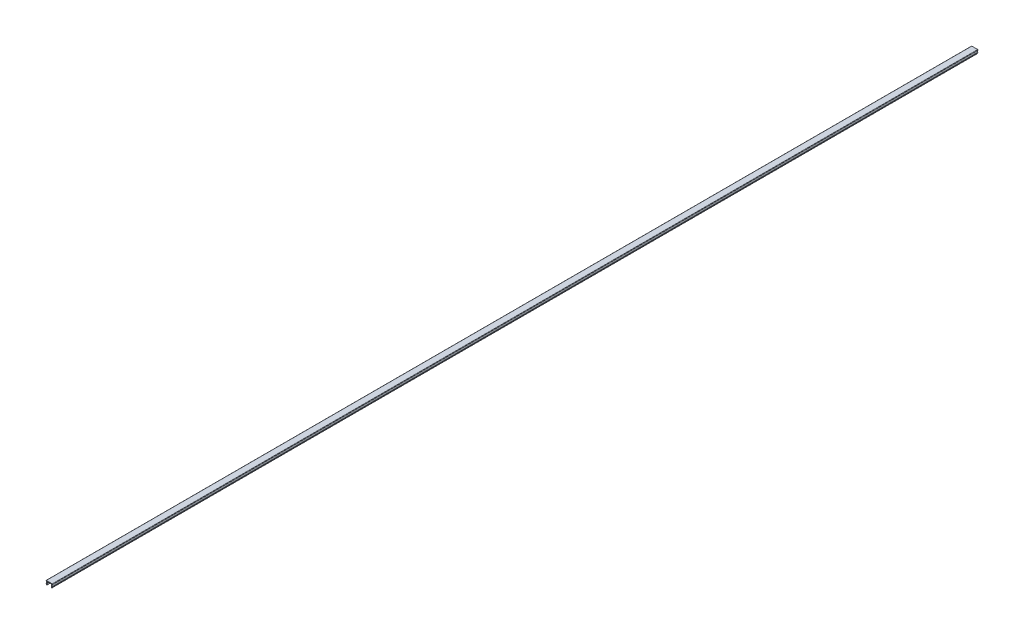
ISO-10303-21;
HEADER;
FILE_DESCRIPTION(('STEP AP214'),'2;1');
FILE_NAME('part.step','',(''),(''),'','','');
FILE_SCHEMA(('AUTOMOTIVE_DESIGN { 1 0 10303 214 1 1 1 1 }'));
ENDSEC;
DATA;
#1=APPLICATION_CONTEXT('core data for automotive mechanical design processes');
#2=APPLICATION_PROTOCOL_DEFINITION('international standard','automotive_design',2000,#1);
#3=PRODUCT_CONTEXT('',#1,'mechanical');
#4=PRODUCT('Part','Part','',(#3));
#5=PRODUCT_RELATED_PRODUCT_CATEGORY('part','',(#4));
#6=PRODUCT_DEFINITION_FORMATION('','',#4);
#7=PRODUCT_DEFINITION_CONTEXT('part definition',#1,'design');
#8=PRODUCT_DEFINITION('design','',#6,#7);
#9=PRODUCT_DEFINITION_SHAPE('','',#8);
#10=(LENGTH_UNIT() NAMED_UNIT(*) SI_UNIT(.MILLI.,.METRE.));
#11=(NAMED_UNIT(*) PLANE_ANGLE_UNIT() SI_UNIT($,.RADIAN.));
#12=(NAMED_UNIT(*) SI_UNIT($,.STERADIAN.) SOLID_ANGLE_UNIT());
#13=UNCERTAINTY_MEASURE_WITH_UNIT(LENGTH_MEASURE(1.E-05),#10,'distance_accuracy_value','');
#14=(GEOMETRIC_REPRESENTATION_CONTEXT(3) GLOBAL_UNCERTAINTY_ASSIGNED_CONTEXT((#13)) GLOBAL_UNIT_ASSIGNED_CONTEXT((#10,
#11,#12)) REPRESENTATION_CONTEXT('',''));
#15=CARTESIAN_POINT('',(0.,0.,0.));
#16=DIRECTION('',(0.,0.,1.));
#17=DIRECTION('',(1.,0.,0.));
#18=AXIS2_PLACEMENT_3D('',#15,#16,#17);
#19=CARTESIAN_POINT('',(-1.62833862518597,3.54999984480356,1000.));
#20=DIRECTION('',(0.,1.,0.));
#21=DIRECTION('',(0.,0.,1.));
#22=AXIS2_PLACEMENT_3D('',#19,#20,#21);
#23=PLANE('',#22);
#24=DIRECTION('',(0.,0.,-1.));
#25=VECTOR('',#24,1.);
#26=CARTESIAN_POINT('',(4.17268348863716,3.54999984480356,1000.));
#27=LINE('',#26,#25);
#28=CARTESIAN_POINT('',(4.17268348863716,3.54999984480356,1000.));
#29=VERTEX_POINT('',#28);
#30=CARTESIAN_POINT('',(4.17268348863716,3.54999984480356,0.));
#31=VERTEX_POINT('',#30);
#32=EDGE_CURVE('E162',#29,#31,#27,.T.);
#33=ORIENTED_EDGE('',*,*,#32,.F.);
#34=DIRECTION('',(1.,0.,0.));
#35=VECTOR('',#34,1.);
#36=CARTESIAN_POINT('',(-1.62833862518597,3.54999984480356,1000.));
#37=LINE('',#36,#35);
#38=CARTESIAN_POINT('',(-0.4293607390091,3.54999984480356,1000.));
#39=VERTEX_POINT('',#38);
#40=EDGE_CURVE('E232',#39,#29,#37,.T.);
#41=ORIENTED_EDGE('',*,*,#40,.F.);
#42=DIRECTION('',(0.,0.,-1.));
#43=VECTOR('',#42,1.);
#44=CARTESIAN_POINT('',(-0.4293607390091,3.54999984480356,1000.));
#45=LINE('',#44,#43);
#46=CARTESIAN_POINT('',(-0.4293607390091,3.54999984480356,0.));
#47=VERTEX_POINT('',#46);
#48=EDGE_CURVE('E245',#39,#47,#45,.T.);
#49=ORIENTED_EDGE('',*,*,#48,.T.);
#50=DIRECTION('',(1.,0.,0.));
#51=VECTOR('',#50,1.);
#52=CARTESIAN_POINT('',(-1.62833862518597,3.54999984480356,0.));
#53=LINE('',#52,#51);
#54=EDGE_CURVE('E240',#47,#31,#53,.T.);
#55=ORIENTED_EDGE('',*,*,#54,.T.);
#56=EDGE_LOOP('',(#33,#41,#49,#55));
#57=FACE_BOUND('',#56,.T.);
#58=ADVANCED_FACE('F16',(#57),#23,.F.);
#59=CARTESIAN_POINT('',(-1.32833862518597,3.54999984480356,1000.));
#60=VERTEX_POINT('',#59);
#61=CARTESIAN_POINT('',(-1.03981651136284,3.54999984480356,1000.));
#62=VERTEX_POINT('',#61);
#63=EDGE_CURVE('E229',#60,#62,#37,.T.);
#64=ORIENTED_EDGE('',*,*,#63,.F.);
#65=DIRECTION('',(0.,0.,-1.));
#66=VECTOR('',#65,1.);
#67=CARTESIAN_POINT('',(-1.32833862518597,3.54999984480356,0.));
#68=LINE('',#67,#66);
#69=CARTESIAN_POINT('',(-1.32833862518597,3.54999984480356,0.));
#70=VERTEX_POINT('',#69);
#71=EDGE_CURVE('E25',#60,#70,#68,.T.);
#72=ORIENTED_EDGE('',*,*,#71,.T.);
#73=CARTESIAN_POINT('',(-1.03981651136284,3.54999984480356,0.));
#74=VERTEX_POINT('',#73);
#75=EDGE_CURVE('E237',#70,#74,#53,.T.);
#76=ORIENTED_EDGE('',*,*,#75,.T.);
#77=DIRECTION('',(0.,0.,-1.));
#78=VECTOR('',#77,1.);
#79=CARTESIAN_POINT('',(-1.03981651136284,3.54999984480356,1000.));
#80=LINE('',#79,#78);
#81=EDGE_CURVE('E236',#62,#74,#80,.T.);
#82=ORIENTED_EDGE('',*,*,#81,.F.);
#83=EDGE_LOOP('',(#64,#72,#76,#82));
#84=FACE_BOUND('',#83,.T.);
#85=ADVANCED_FACE('F318',(#84),#23,.F.);
#86=CARTESIAN_POINT('',(4.7831392609909,3.54999984480356,0.));
#87=VERTEX_POINT('',#86);
#88=CARTESIAN_POINT('',(5.07166137481403,3.54999984480356,0.));
#89=VERTEX_POINT('',#88);
#90=EDGE_CURVE('E228',#87,#89,#53,.T.);
#91=ORIENTED_EDGE('',*,*,#90,.T.);
#92=DIRECTION('',(0.,0.,-1.));
#93=VECTOR('',#92,1.);
#94=CARTESIAN_POINT('',(5.07166137481403,3.54999984480356,1000.));
#95=LINE('',#94,#93);
#96=CARTESIAN_POINT('',(5.07166137481403,3.54999984480356,1000.));
#97=VERTEX_POINT('',#96);
#98=EDGE_CURVE('E10',#89,#97,#95,.F.);
#99=ORIENTED_EDGE('',*,*,#98,.T.);
#100=CARTESIAN_POINT('',(4.7831392609909,3.54999984480356,1000.));
#101=VERTEX_POINT('',#100);
#102=EDGE_CURVE('E233',#101,#97,#37,.T.);
#103=ORIENTED_EDGE('',*,*,#102,.F.);
#104=DIRECTION('',(0.,0.,-1.));
#105=VECTOR('',#104,1.);
#106=CARTESIAN_POINT('',(4.7831392609909,3.54999984480356,1000.));
#107=LINE('',#106,#105);
#108=EDGE_CURVE('E191',#101,#87,#107,.T.);
#109=ORIENTED_EDGE('',*,*,#108,.T.);
#110=EDGE_LOOP('',(#91,#99,#103,#109));
#111=FACE_BOUND('',#110,.T.);
#112=ADVANCED_FACE('F287',(#111),#23,.F.);
#113=CARTESIAN_POINT('',(-1.62833862518597,4.14999984480356,1000.));
#114=DIRECTION('',(0.,1.,0.));
#115=DIRECTION('',(0.,0.,1.));
#116=AXIS2_PLACEMENT_3D('',#113,#114,#115);
#117=PLANE('',#116);
#118=DIRECTION('',(1.,0.,0.));
#119=VECTOR('',#118,1.);
#120=CARTESIAN_POINT('',(-1.62833862518597,4.14999984480356,0.));
#121=LINE('',#120,#119);
#122=CARTESIAN_POINT('',(-1.32833862518597,4.14999984480356,0.));
#123=VERTEX_POINT('',#122);
#124=CARTESIAN_POINT('',(5.07166137481403,4.14999984480356,0.));
#125=VERTEX_POINT('',#124);
#126=EDGE_CURVE('E239',#123,#125,#121,.T.);
#127=ORIENTED_EDGE('',*,*,#126,.F.);
#128=DIRECTION('',(0.,0.,-1.));
#129=VECTOR('',#128,1.);
#130=CARTESIAN_POINT('',(-1.32833862518597,4.14999984480356,1000.));
#131=LINE('',#130,#129);
#132=CARTESIAN_POINT('',(-1.32833862518597,4.14999984480356,1000.));
#133=VERTEX_POINT('',#132);
#134=EDGE_CURVE('E258',#123,#133,#131,.F.);
#135=ORIENTED_EDGE('',*,*,#134,.T.);
#136=DIRECTION('',(1.,0.,0.));
#137=VECTOR('',#136,1.);
#138=CARTESIAN_POINT('',(-1.62833862518597,4.14999984480356,1000.));
#139=LINE('',#138,#137);
#140=CARTESIAN_POINT('',(5.07166137481403,4.14999984480356,1000.));
#141=VERTEX_POINT('',#140);
#142=EDGE_CURVE('E231',#133,#141,#139,.T.);
#143=ORIENTED_EDGE('',*,*,#142,.T.);
#144=DIRECTION('',(0.,0.,-1.));
#145=VECTOR('',#144,1.);
#146=CARTESIAN_POINT('',(5.07166137481403,4.14999984480356,1000.));
#147=LINE('',#146,#145);
#148=EDGE_CURVE('E255',#141,#125,#147,.T.);
#149=ORIENTED_EDGE('',*,*,#148,.T.);
#150=EDGE_LOOP('',(#127,#135,#143,#149));
#151=FACE_BOUND('',#150,.T.);
#152=ADVANCED_FACE('F327',(#151),#117,.T.);
#153=CARTESIAN_POINT('',(0.,0.,1000.));
#154=DIRECTION('',(0.,0.,-1.));
#155=DIRECTION('',(-1.,0.,0.));
#156=AXIS2_PLACEMENT_3D('',#153,#154,#155);
#157=PLANE('',#156);
#158=ORIENTED_EDGE('',*,*,#142,.F.);
#159=CARTESIAN_POINT('',(-1.32833862518597,3.84999984480356,1000.));
#160=DIRECTION('',(0.,0.,-1.));
#161=DIRECTION('',(-1.,0.,0.));
#162=AXIS2_PLACEMENT_3D('',#159,#160,#161);
#163=CIRCLE('',#162,0.3);
#164=CARTESIAN_POINT('',(-1.62833862518597,3.84999984480356,1000.));
#165=VERTEX_POINT('',#164);
#166=EDGE_CURVE('E38',#133,#165,#163,.F.);
#167=ORIENTED_EDGE('',*,*,#166,.T.);
#168=CARTESIAN_POINT('',(-1.32833862518597,3.84999984480356,1000.));
#169=DIRECTION('',(0.,0.,-1.));
#170=DIRECTION('',(-1.,0.,0.));
#171=AXIS2_PLACEMENT_3D('',#168,#169,#170);
#172=CIRCLE('',#171,0.3);
#173=EDGE_CURVE('E33',#165,#60,#172,.F.);
#174=ORIENTED_EDGE('',*,*,#173,.T.);
#175=ORIENTED_EDGE('',*,*,#63,.T.);
#176=DIRECTION('',(-0.184288535050186,-0.982872186934322,0.));
#177=VECTOR('',#176,1.);
#178=CARTESIAN_POINT('',(-0.973200281266266,3.90528640531861,1000.));
#179=LINE('',#178,#177);
#180=CARTESIAN_POINT('',(-1.43752646810523,1.42888007551082,1000.));
#181=VERTEX_POINT('',#180);
#182=EDGE_CURVE('E205',#62,#181,#179,.T.);
#183=ORIENTED_EDGE('',*,*,#182,.T.);
#184=DIRECTION('',(0.316227766016838,-0.948683298050514,0.));
#185=VECTOR('',#184,1.);
#186=CARTESIAN_POINT('',(-1.41294361460112,1.35513151499851,1000.));
#187=LINE('',#186,#185);
#188=CARTESIAN_POINT('',(-1.01294361460112,0.155131514998506,1000.));
#189=VERTEX_POINT('',#188);
#190=EDGE_CURVE('E194',#181,#189,#187,.T.);
#191=ORIENTED_EDGE('',*,*,#190,.T.);
#192=DIRECTION('',(-0.948683298050514,-0.316227766016838,0.));
#193=VECTOR('',#192,1.);
#194=CARTESIAN_POINT('',(-0.443733635770816,0.344868174608609,1000.));
#195=LINE('',#194,#193);
#196=CARTESIAN_POINT('',(-0.443733635770816,0.344868174608609,1000.));
#197=VERTEX_POINT('',#196);
#198=EDGE_CURVE('E196',#197,#189,#195,.T.);
#199=ORIENTED_EDGE('',*,*,#198,.F.);
#200=DIRECTION('',(0.316227766016838,-0.948683298050514,0.));
#201=VECTOR('',#200,1.);
#202=CARTESIAN_POINT('',(-0.843733635770816,1.54486817460861,1000.));
#203=LINE('',#202,#201);
#204=CARTESIAN_POINT('',(-0.819150782266712,1.4711196140963,1000.));
#205=VERTEX_POINT('',#204);
#206=EDGE_CURVE('E200',#205,#197,#203,.T.);
#207=ORIENTED_EDGE('',*,*,#206,.F.);
#208=DIRECTION('',(-0.184288535050186,-0.982872186934322,0.));
#209=VECTOR('',#208,1.);
#210=CARTESIAN_POINT('',(-0.383476969105673,3.7947132842885,1000.));
#211=LINE('',#210,#209);
#212=EDGE_CURVE('E203',#39,#205,#211,.T.);
#213=ORIENTED_EDGE('',*,*,#212,.F.);
#214=ORIENTED_EDGE('',*,*,#40,.T.);
#215=DIRECTION('',(0.184288535050186,-0.982872186934322,0.));
#216=VECTOR('',#215,1.);
#217=CARTESIAN_POINT('',(4.12679971873373,3.7947132842885,1000.));
#218=LINE('',#217,#216);
#219=CARTESIAN_POINT('',(4.56247353189477,1.4711196140963,1000.));
#220=VERTEX_POINT('',#219);
#221=EDGE_CURVE('E148',#29,#220,#218,.T.);
#222=ORIENTED_EDGE('',*,*,#221,.T.);
#223=DIRECTION('',(-0.316227766016838,-0.948683298050514,0.));
#224=VECTOR('',#223,1.);
#225=CARTESIAN_POINT('',(4.58705638539888,1.54486817460861,1000.));
#226=LINE('',#225,#224);
#227=CARTESIAN_POINT('',(4.18705638539888,0.34486817460861,1000.));
#228=VERTEX_POINT('',#227);
#229=EDGE_CURVE('E139',#220,#228,#226,.T.);
#230=ORIENTED_EDGE('',*,*,#229,.T.);
#231=DIRECTION('',(-0.948683298050514,0.316227766016838,0.));
#232=VECTOR('',#231,1.);
#233=CARTESIAN_POINT('',(4.75626636422918,0.155131514998507,1000.));
#234=LINE('',#233,#232);
#235=CARTESIAN_POINT('',(4.75626636422918,0.155131514998507,1000.));
#236=VERTEX_POINT('',#235);
#237=EDGE_CURVE('E144',#236,#228,#234,.T.);
#238=ORIENTED_EDGE('',*,*,#237,.F.);
#239=DIRECTION('',(-0.316227766016838,-0.948683298050514,0.));
#240=VECTOR('',#239,1.);
#241=CARTESIAN_POINT('',(5.15626636422918,1.35513151499851,1000.));
#242=LINE('',#241,#240);
#243=CARTESIAN_POINT('',(5.18084921773329,1.42888007551082,1000.));
#244=VERTEX_POINT('',#243);
#245=EDGE_CURVE('E166',#244,#236,#242,.T.);
#246=ORIENTED_EDGE('',*,*,#245,.F.);
#247=DIRECTION('',(0.184288535050186,-0.982872186934322,0.));
#248=VECTOR('',#247,1.);
#249=CARTESIAN_POINT('',(4.71652303089433,3.90528640531861,1000.));
#250=LINE('',#249,#248);
#251=EDGE_CURVE('E168',#101,#244,#250,.T.);
#252=ORIENTED_EDGE('',*,*,#251,.F.);
#253=ORIENTED_EDGE('',*,*,#102,.T.);
#254=CARTESIAN_POINT('',(5.07166137481403,3.84999984480356,1000.));
#255=DIRECTION('',(0.,0.,-1.));
#256=DIRECTION('',(-1.,0.,0.));
#257=AXIS2_PLACEMENT_3D('',#254,#255,#256);
#258=CIRCLE('',#257,0.3);
#259=CARTESIAN_POINT('',(5.37166137481403,3.84999984480356,1000.));
#260=VERTEX_POINT('',#259);
#261=EDGE_CURVE('E261',#97,#260,#258,.F.);
#262=ORIENTED_EDGE('',*,*,#261,.T.);
#263=CARTESIAN_POINT('',(5.07166137481403,3.84999984480356,1000.));
#264=DIRECTION('',(0.,0.,-1.));
#265=DIRECTION('',(-1.,0.,0.));
#266=AXIS2_PLACEMENT_3D('',#263,#264,#265);
#267=CIRCLE('',#266,0.3);
#268=EDGE_CURVE('E263',#260,#141,#267,.F.);
#269=ORIENTED_EDGE('',*,*,#268,.T.);
#270=EDGE_LOOP('',(#158,#167,#174,#175,#183,#191,#199,#207,#213,#214,#222,#230,#238,#246,#252,
#253,#262,#269));
#271=FACE_BOUND('',#270,.T.);
#272=ADVANCED_FACE('F141',(#271),#157,.F.);
#273=CARTESIAN_POINT('',(0.,0.,0.));
#274=DIRECTION('',(0.,0.,-1.));
#275=DIRECTION('',(-1.,0.,0.));
#276=AXIS2_PLACEMENT_3D('',#273,#274,#275);
#277=PLANE('',#276);
#278=CARTESIAN_POINT('',(-1.32833862518597,3.84999984480356,0.));
#279=DIRECTION('',(0.,0.,-1.));
#280=DIRECTION('',(-1.,0.,0.));
#281=AXIS2_PLACEMENT_3D('',#278,#279,#280);
#282=CIRCLE('',#281,0.3);
#283=CARTESIAN_POINT('',(-1.62833862518597,3.84999984480356,0.));
#284=VERTEX_POINT('',#283);
#285=EDGE_CURVE('E251',#70,#284,#282,.T.);
#286=ORIENTED_EDGE('',*,*,#285,.T.);
#287=CARTESIAN_POINT('',(-1.32833862518597,3.84999984480356,0.));
#288=DIRECTION('',(0.,0.,-1.));
#289=DIRECTION('',(-1.,0.,0.));
#290=AXIS2_PLACEMENT_3D('',#287,#288,#289);
#291=CIRCLE('',#290,0.3);
#292=EDGE_CURVE('E253',#284,#123,#291,.T.);
#293=ORIENTED_EDGE('',*,*,#292,.T.);
#294=ORIENTED_EDGE('',*,*,#126,.T.);
#295=CARTESIAN_POINT('',(5.07166137481403,3.84999984480356,0.));
#296=DIRECTION('',(0.,0.,-1.));
#297=DIRECTION('',(-1.,0.,0.));
#298=AXIS2_PLACEMENT_3D('',#295,#296,#297);
#299=CIRCLE('',#298,0.3);
#300=CARTESIAN_POINT('',(5.37166137481403,3.84999984480356,0.));
#301=VERTEX_POINT('',#300);
#302=EDGE_CURVE('E249',#125,#301,#299,.T.);
#303=ORIENTED_EDGE('',*,*,#302,.T.);
#304=CARTESIAN_POINT('',(5.07166137481403,3.84999984480356,0.));
#305=DIRECTION('',(0.,0.,-1.));
#306=DIRECTION('',(-1.,0.,0.));
#307=AXIS2_PLACEMENT_3D('',#304,#305,#306);
#308=CIRCLE('',#307,0.3);
#309=EDGE_CURVE('E247',#301,#89,#308,.T.);
#310=ORIENTED_EDGE('',*,*,#309,.T.);
#311=ORIENTED_EDGE('',*,*,#90,.F.);
#312=DIRECTION('',(0.184288535050186,-0.982872186934322,0.));
#313=VECTOR('',#312,1.);
#314=CARTESIAN_POINT('',(4.71652303089433,3.90528640531861,0.));
#315=LINE('',#314,#313);
#316=CARTESIAN_POINT('',(5.18084921773329,1.42888007551082,0.));
#317=VERTEX_POINT('',#316);
#318=EDGE_CURVE('E181',#87,#317,#315,.T.);
#319=ORIENTED_EDGE('',*,*,#318,.T.);
#320=DIRECTION('',(-0.316227766016838,-0.948683298050514,0.));
#321=VECTOR('',#320,1.);
#322=CARTESIAN_POINT('',(5.15626636422918,1.35513151499851,0.));
#323=LINE('',#322,#321);
#324=CARTESIAN_POINT('',(4.75626636422918,0.155131514998507,0.));
#325=VERTEX_POINT('',#324);
#326=EDGE_CURVE('E178',#317,#325,#323,.T.);
#327=ORIENTED_EDGE('',*,*,#326,.T.);
#328=DIRECTION('',(-0.948683298050514,0.316227766016838,0.));
#329=VECTOR('',#328,1.);
#330=CARTESIAN_POINT('',(4.75626636422918,0.155131514998507,0.));
#331=LINE('',#330,#329);
#332=CARTESIAN_POINT('',(4.18705638539888,0.34486817460861,0.));
#333=VERTEX_POINT('',#332);
#334=EDGE_CURVE('E175',#325,#333,#331,.T.);
#335=ORIENTED_EDGE('',*,*,#334,.T.);
#336=DIRECTION('',(-0.316227766016838,-0.948683298050514,0.));
#337=VECTOR('',#336,1.);
#338=CARTESIAN_POINT('',(4.58705638539888,1.54486817460861,0.));
#339=LINE('',#338,#337);
#340=CARTESIAN_POINT('',(4.56247353189477,1.4711196140963,0.));
#341=VERTEX_POINT('',#340);
#342=EDGE_CURVE('E158',#341,#333,#339,.T.);
#343=ORIENTED_EDGE('',*,*,#342,.F.);
#344=DIRECTION('',(0.184288535050186,-0.982872186934322,0.));
#345=VECTOR('',#344,1.);
#346=CARTESIAN_POINT('',(4.12679971873373,3.7947132842885,0.));
#347=LINE('',#346,#345);
#348=EDGE_CURVE('E152',#31,#341,#347,.T.);
#349=ORIENTED_EDGE('',*,*,#348,.F.);
#350=ORIENTED_EDGE('',*,*,#54,.F.);
#351=DIRECTION('',(-0.184288535050186,-0.982872186934322,0.));
#352=VECTOR('',#351,1.);
#353=CARTESIAN_POINT('',(-0.383476969105673,3.7947132842885,0.));
#354=LINE('',#353,#352);
#355=CARTESIAN_POINT('',(-0.819150782266712,1.4711196140963,0.));
#356=VERTEX_POINT('',#355);
#357=EDGE_CURVE('E216',#47,#356,#354,.T.);
#358=ORIENTED_EDGE('',*,*,#357,.T.);
#359=DIRECTION('',(0.316227766016838,-0.948683298050514,0.));
#360=VECTOR('',#359,1.);
#361=CARTESIAN_POINT('',(-0.843733635770816,1.54486817460861,0.));
#362=LINE('',#361,#360);
#363=CARTESIAN_POINT('',(-0.443733635770816,0.344868174608609,0.));
#364=VERTEX_POINT('',#363);
#365=EDGE_CURVE('E213',#356,#364,#362,.T.);
#366=ORIENTED_EDGE('',*,*,#365,.T.);
#367=DIRECTION('',(-0.948683298050514,-0.316227766016838,0.));
#368=VECTOR('',#367,1.);
#369=CARTESIAN_POINT('',(-0.443733635770816,0.344868174608609,0.));
#370=LINE('',#369,#368);
#371=CARTESIAN_POINT('',(-1.01294361460112,0.155131514998506,0.));
#372=VERTEX_POINT('',#371);
#373=EDGE_CURVE('E210',#364,#372,#370,.T.);
#374=ORIENTED_EDGE('',*,*,#373,.T.);
#375=DIRECTION('',(0.316227766016838,-0.948683298050514,0.));
#376=VECTOR('',#375,1.);
#377=CARTESIAN_POINT('',(-1.41294361460112,1.35513151499851,0.));
#378=LINE('',#377,#376);
#379=CARTESIAN_POINT('',(-1.43752646810523,1.42888007551082,0.));
#380=VERTEX_POINT('',#379);
#381=EDGE_CURVE('E193',#380,#372,#378,.T.);
#382=ORIENTED_EDGE('',*,*,#381,.F.);
#383=DIRECTION('',(-0.184288535050186,-0.982872186934322,0.));
#384=VECTOR('',#383,1.);
#385=CARTESIAN_POINT('',(-0.973200281266266,3.90528640531861,0.));
#386=LINE('',#385,#384);
#387=EDGE_CURVE('E197',#74,#380,#386,.T.);
#388=ORIENTED_EDGE('',*,*,#387,.F.);
#389=ORIENTED_EDGE('',*,*,#75,.F.);
#390=EDGE_LOOP('',(#286,#293,#294,#303,#310,#311,#319,#327,#335,#343,#349,#350,#358,#366,#374,
#382,#388,#389));
#391=FACE_BOUND('',#390,.T.);
#392=ADVANCED_FACE('F284',(#391),#277,.T.);
#393=CARTESIAN_POINT('',(-0.383476969105673,3.7947132842885,1000.));
#394=DIRECTION('',(0.982872186934322,-0.184288535050186,0.));
#395=DIRECTION('',(0.184288535050186,0.982872186934322,0.));
#396=AXIS2_PLACEMENT_3D('',#393,#394,#395);
#397=PLANE('',#396);
#398=ORIENTED_EDGE('',*,*,#48,.F.);
#399=ORIENTED_EDGE('',*,*,#212,.T.);
#400=DIRECTION('',(0.,0.,-1.));
#401=VECTOR('',#400,1.);
#402=CARTESIAN_POINT('',(-0.819150782266712,1.4711196140963,1000.));
#403=LINE('',#402,#401);
#404=EDGE_CURVE('E221',#205,#356,#403,.T.);
#405=ORIENTED_EDGE('',*,*,#404,.T.);
#406=ORIENTED_EDGE('',*,*,#357,.F.);
#407=EDGE_LOOP('',(#398,#399,#405,#406));
#408=FACE_BOUND('',#407,.T.);
#409=ADVANCED_FACE('F339',(#408),#397,.T.);
#410=CARTESIAN_POINT('',(-0.973200281266266,3.90528640531861,1000.));
#411=DIRECTION('',(0.982872186934322,-0.184288535050186,0.));
#412=DIRECTION('',(0.184288535050186,0.982872186934322,0.));
#413=AXIS2_PLACEMENT_3D('',#410,#411,#412);
#414=PLANE('',#413);
#415=ORIENTED_EDGE('',*,*,#182,.F.);
#416=ORIENTED_EDGE('',*,*,#81,.T.);
#417=ORIENTED_EDGE('',*,*,#387,.T.);
#418=DIRECTION('',(0.,0.,-1.));
#419=VECTOR('',#418,1.);
#420=CARTESIAN_POINT('',(-1.43752646810523,1.42888007551082,1000.));
#421=LINE('',#420,#419);
#422=EDGE_CURVE('E207',#181,#380,#421,.T.);
#423=ORIENTED_EDGE('',*,*,#422,.F.);
#424=EDGE_LOOP('',(#415,#416,#417,#423));
#425=FACE_BOUND('',#424,.T.);
#426=ADVANCED_FACE('F344',(#425),#414,.F.);
#427=CARTESIAN_POINT('',(-1.41294361460112,1.35513151499851,1000.));
#428=DIRECTION('',(0.948683298050514,0.316227766016838,0.));
#429=DIRECTION('',(-0.316227766016838,0.948683298050514,0.));
#430=AXIS2_PLACEMENT_3D('',#427,#428,#429);
#431=PLANE('',#430);
#432=ORIENTED_EDGE('',*,*,#381,.T.);
#433=DIRECTION('',(0.,0.,-1.));
#434=VECTOR('',#433,1.);
#435=CARTESIAN_POINT('',(-1.01294361460112,0.155131514998506,1000.));
#436=LINE('',#435,#434);
#437=EDGE_CURVE('E226',#189,#372,#436,.T.);
#438=ORIENTED_EDGE('',*,*,#437,.F.);
#439=ORIENTED_EDGE('',*,*,#190,.F.);
#440=ORIENTED_EDGE('',*,*,#422,.T.);
#441=EDGE_LOOP('',(#432,#438,#439,#440));
#442=FACE_BOUND('',#441,.T.);
#443=ADVANCED_FACE('F341',(#442),#431,.F.);
#444=CARTESIAN_POINT('',(-0.443733635770816,0.344868174608609,1000.));
#445=DIRECTION('',(0.316227766016838,-0.948683298050514,0.));
#446=DIRECTION('',(0.948683298050514,0.316227766016838,0.));
#447=AXIS2_PLACEMENT_3D('',#444,#445,#446);
#448=PLANE('',#447);
#449=ORIENTED_EDGE('',*,*,#373,.F.);
#450=DIRECTION('',(0.,0.,-1.));
#451=VECTOR('',#450,1.);
#452=CARTESIAN_POINT('',(-0.443733635770816,0.344868174608609,1000.));
#453=LINE('',#452,#451);
#454=EDGE_CURVE('E224',#197,#364,#453,.T.);
#455=ORIENTED_EDGE('',*,*,#454,.F.);
#456=ORIENTED_EDGE('',*,*,#198,.T.);
#457=ORIENTED_EDGE('',*,*,#437,.T.);
#458=EDGE_LOOP('',(#449,#455,#456,#457));
#459=FACE_BOUND('',#458,.T.);
#460=ADVANCED_FACE('F313',(#459),#448,.T.);
#461=CARTESIAN_POINT('',(-0.843733635770816,1.54486817460861,1000.));
#462=DIRECTION('',(0.948683298050514,0.316227766016838,0.));
#463=DIRECTION('',(-0.316227766016838,0.948683298050514,0.));
#464=AXIS2_PLACEMENT_3D('',#461,#462,#463);
#465=PLANE('',#464);
#466=ORIENTED_EDGE('',*,*,#365,.F.);
#467=ORIENTED_EDGE('',*,*,#404,.F.);
#468=ORIENTED_EDGE('',*,*,#206,.T.);
#469=ORIENTED_EDGE('',*,*,#454,.T.);
#470=EDGE_LOOP('',(#466,#467,#468,#469));
#471=FACE_BOUND('',#470,.T.);
#472=ADVANCED_FACE('F305',(#471),#465,.T.);
#473=CARTESIAN_POINT('',(4.71652303089433,3.90528640531861,1000.));
#474=DIRECTION('',(0.982872186934322,0.184288535050186,0.));
#475=DIRECTION('',(-0.184288535050186,0.982872186934322,0.));
#476=AXIS2_PLACEMENT_3D('',#473,#474,#475);
#477=PLANE('',#476);
#478=ORIENTED_EDGE('',*,*,#108,.F.);
#479=ORIENTED_EDGE('',*,*,#251,.T.);
#480=DIRECTION('',(0.,0.,-1.));
#481=VECTOR('',#480,1.);
#482=CARTESIAN_POINT('',(5.18084921773329,1.42888007551082,1000.));
#483=LINE('',#482,#481);
#484=EDGE_CURVE('E185',#244,#317,#483,.T.);
#485=ORIENTED_EDGE('',*,*,#484,.T.);
#486=ORIENTED_EDGE('',*,*,#318,.F.);
#487=EDGE_LOOP('',(#478,#479,#485,#486));
#488=FACE_BOUND('',#487,.T.);
#489=ADVANCED_FACE('F303',(#488),#477,.T.);
#490=CARTESIAN_POINT('',(4.12679971873373,3.7947132842885,1000.));
#491=DIRECTION('',(0.982872186934322,0.184288535050186,0.));
#492=DIRECTION('',(-0.184288535050186,0.982872186934322,0.));
#493=AXIS2_PLACEMENT_3D('',#490,#491,#492);
#494=PLANE('',#493);
#495=ORIENTED_EDGE('',*,*,#221,.F.);
#496=ORIENTED_EDGE('',*,*,#32,.T.);
#497=ORIENTED_EDGE('',*,*,#348,.T.);
#498=DIRECTION('',(0.,0.,-1.));
#499=VECTOR('',#498,1.);
#500=CARTESIAN_POINT('',(4.56247353189477,1.4711196140963,1000.));
#501=LINE('',#500,#499);
#502=EDGE_CURVE('E173',#220,#341,#501,.T.);
#503=ORIENTED_EDGE('',*,*,#502,.F.);
#504=EDGE_LOOP('',(#495,#496,#497,#503));
#505=FACE_BOUND('',#504,.T.);
#506=ADVANCED_FACE('F296',(#505),#494,.F.);
#507=CARTESIAN_POINT('',(4.58705638539888,1.54486817460861,1000.));
#508=DIRECTION('',(0.948683298050514,-0.316227766016838,0.));
#509=DIRECTION('',(0.316227766016838,0.948683298050514,0.));
#510=AXIS2_PLACEMENT_3D('',#507,#508,#509);
#511=PLANE('',#510);
#512=ORIENTED_EDGE('',*,*,#342,.T.);
#513=DIRECTION('',(0.,0.,-1.));
#514=VECTOR('',#513,1.);
#515=CARTESIAN_POINT('',(4.18705638539888,0.34486817460861,1000.));
#516=LINE('',#515,#514);
#517=EDGE_CURVE('E155',#228,#333,#516,.T.);
#518=ORIENTED_EDGE('',*,*,#517,.F.);
#519=ORIENTED_EDGE('',*,*,#229,.F.);
#520=ORIENTED_EDGE('',*,*,#502,.T.);
#521=EDGE_LOOP('',(#512,#518,#519,#520));
#522=FACE_BOUND('',#521,.T.);
#523=ADVANCED_FACE('F156',(#522),#511,.F.);
#524=CARTESIAN_POINT('',(4.75626636422918,0.155131514998507,1000.));
#525=DIRECTION('',(-0.316227766016838,-0.948683298050514,0.));
#526=DIRECTION('',(0.948683298050514,-0.316227766016838,0.));
#527=AXIS2_PLACEMENT_3D('',#524,#525,#526);
#528=PLANE('',#527);
#529=ORIENTED_EDGE('',*,*,#334,.F.);
#530=DIRECTION('',(0.,0.,-1.));
#531=VECTOR('',#530,1.);
#532=CARTESIAN_POINT('',(4.75626636422918,0.155131514998507,1000.));
#533=LINE('',#532,#531);
#534=EDGE_CURVE('E163',#236,#325,#533,.T.);
#535=ORIENTED_EDGE('',*,*,#534,.F.);
#536=ORIENTED_EDGE('',*,*,#237,.T.);
#537=ORIENTED_EDGE('',*,*,#517,.T.);
#538=EDGE_LOOP('',(#529,#535,#536,#537));
#539=FACE_BOUND('',#538,.T.);
#540=ADVANCED_FACE('F165',(#539),#528,.T.);
#541=CARTESIAN_POINT('',(5.15626636422918,1.35513151499851,1000.));
#542=DIRECTION('',(0.948683298050514,-0.316227766016838,0.));
#543=DIRECTION('',(0.316227766016838,0.948683298050514,0.));
#544=AXIS2_PLACEMENT_3D('',#541,#542,#543);
#545=PLANE('',#544);
#546=ORIENTED_EDGE('',*,*,#326,.F.);
#547=ORIENTED_EDGE('',*,*,#484,.F.);
#548=ORIENTED_EDGE('',*,*,#245,.T.);
#549=ORIENTED_EDGE('',*,*,#534,.T.);
#550=EDGE_LOOP('',(#546,#547,#548,#549));
#551=FACE_BOUND('',#550,.T.);
#552=ADVANCED_FACE('F300',(#551),#545,.T.);
#553=CARTESIAN_POINT('',(-1.32833862518597,3.84999984480356,1000.));
#554=DIRECTION('',(0.,0.,1.));
#555=DIRECTION('',(1.,0.,0.));
#556=AXIS2_PLACEMENT_3D('',#553,#554,#555);
#557=CYLINDRICAL_SURFACE('',#556,0.3);
#558=ORIENTED_EDGE('',*,*,#71,.F.);
#559=ORIENTED_EDGE('',*,*,#173,.F.);
#560=DIRECTION('',(0.,0.,-1.));
#561=VECTOR('',#560,1.);
#562=CARTESIAN_POINT('',(-1.62833862518597,3.84999984480356,1000.));
#563=LINE('',#562,#561);
#564=EDGE_CURVE('E176',#284,#165,#563,.F.);
#565=ORIENTED_EDGE('',*,*,#564,.F.);
#566=ORIENTED_EDGE('',*,*,#285,.F.);
#567=EDGE_LOOP('',(#558,#559,#565,#566));
#568=FACE_BOUND('',#567,.T.);
#569=ADVANCED_FACE('F359',(#568),#557,.T.);
#570=CARTESIAN_POINT('',(-1.32833862518597,3.84999984480356,1000.));
#571=DIRECTION('',(0.,0.,-1.));
#572=DIRECTION('',(-1.,0.,0.));
#573=AXIS2_PLACEMENT_3D('',#570,#571,#572);
#574=CYLINDRICAL_SURFACE('',#573,0.3);
#575=ORIENTED_EDGE('',*,*,#166,.F.);
#576=ORIENTED_EDGE('',*,*,#134,.F.);
#577=ORIENTED_EDGE('',*,*,#292,.F.);
#578=ORIENTED_EDGE('',*,*,#564,.T.);
#579=EDGE_LOOP('',(#575,#576,#577,#578));
#580=FACE_BOUND('',#579,.T.);
#581=ADVANCED_FACE('F363',(#580),#574,.T.);
#582=CARTESIAN_POINT('',(5.07166137481403,3.84999984480356,1000.));
#583=DIRECTION('',(0.,0.,1.));
#584=DIRECTION('',(1.,0.,0.));
#585=AXIS2_PLACEMENT_3D('',#582,#583,#584);
#586=CYLINDRICAL_SURFACE('',#585,0.3);
#587=DIRECTION('',(0.,0.,-1.));
#588=VECTOR('',#587,1.);
#589=CARTESIAN_POINT('',(5.37166137481403,3.84999984480356,0.));
#590=LINE('',#589,#588);
#591=EDGE_CURVE('E20',#260,#301,#590,.T.);
#592=ORIENTED_EDGE('',*,*,#591,.F.);
#593=ORIENTED_EDGE('',*,*,#261,.F.);
#594=ORIENTED_EDGE('',*,*,#98,.F.);
#595=ORIENTED_EDGE('',*,*,#309,.F.);
#596=EDGE_LOOP('',(#592,#593,#594,#595));
#597=FACE_BOUND('',#596,.T.);
#598=ADVANCED_FACE('F18',(#597),#586,.T.);
#599=CARTESIAN_POINT('',(5.07166137481403,3.84999984480356,1000.));
#600=DIRECTION('',(0.,0.,-1.));
#601=DIRECTION('',(-1.,0.,0.));
#602=AXIS2_PLACEMENT_3D('',#599,#600,#601);
#603=CYLINDRICAL_SURFACE('',#602,0.3);
#604=ORIENTED_EDGE('',*,*,#268,.F.);
#605=ORIENTED_EDGE('',*,*,#591,.T.);
#606=ORIENTED_EDGE('',*,*,#302,.F.);
#607=ORIENTED_EDGE('',*,*,#148,.F.);
#608=EDGE_LOOP('',(#604,#605,#606,#607));
#609=FACE_BOUND('',#608,.T.);
#610=ADVANCED_FACE('F275',(#609),#603,.T.);
#611=CLOSED_SHELL('',(#58,#85,#112,#152,#272,#392,#409,#426,#443,#460,#472,#489,#506,#523,#540,
#552,#569,#581,#598,#610));
#612=MANIFOLD_SOLID_BREP('B1',#611);
#613=ADVANCED_BREP_SHAPE_REPRESENTATION('',(#18,#612),#14);
#614=SHAPE_DEFINITION_REPRESENTATION(#9,#613);
ENDSEC;
END-ISO-10303-21;
